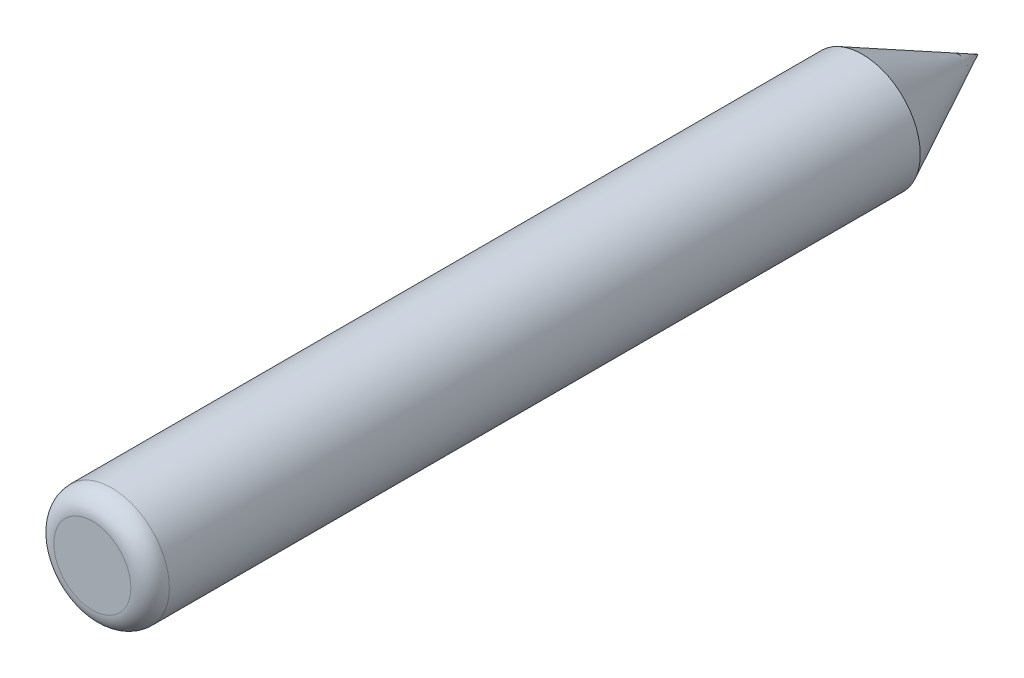
ISO-10303-21;
HEADER;
FILE_DESCRIPTION(('STEP AP214'),'2;1');
FILE_NAME('part.step','',(''),(''),'','','');
FILE_SCHEMA(('AUTOMOTIVE_DESIGN { 1 0 10303 214 1 1 1 1 }'));
ENDSEC;
DATA;
#1=APPLICATION_CONTEXT('core data for automotive mechanical design processes');
#2=APPLICATION_PROTOCOL_DEFINITION('international standard','automotive_design',2000,#1);
#3=PRODUCT_CONTEXT('',#1,'mechanical');
#4=PRODUCT('Part','Part','',(#3));
#5=PRODUCT_RELATED_PRODUCT_CATEGORY('part','',(#4));
#6=PRODUCT_DEFINITION_FORMATION('','',#4);
#7=PRODUCT_DEFINITION_CONTEXT('part definition',#1,'design');
#8=PRODUCT_DEFINITION('design','',#6,#7);
#9=PRODUCT_DEFINITION_SHAPE('','',#8);
#10=(LENGTH_UNIT() NAMED_UNIT(*) SI_UNIT(.MILLI.,.METRE.));
#11=(NAMED_UNIT(*) PLANE_ANGLE_UNIT() SI_UNIT($,.RADIAN.));
#12=(NAMED_UNIT(*) SI_UNIT($,.STERADIAN.) SOLID_ANGLE_UNIT());
#13=UNCERTAINTY_MEASURE_WITH_UNIT(LENGTH_MEASURE(1.E-05),#10,'distance_accuracy_value','');
#14=(GEOMETRIC_REPRESENTATION_CONTEXT(3) GLOBAL_UNCERTAINTY_ASSIGNED_CONTEXT((#13)) GLOBAL_UNIT_ASSIGNED_CONTEXT((#10,
#11,#12)) REPRESENTATION_CONTEXT('',''));
#15=CARTESIAN_POINT('',(0.,0.,0.));
#16=DIRECTION('',(0.,0.,1.));
#17=DIRECTION('',(1.,0.,0.));
#18=AXIS2_PLACEMENT_3D('',#15,#16,#17);
#19=CARTESIAN_POINT('',(0.,0.,80.));
#20=DIRECTION('',(0.,0.,-1.));
#21=DIRECTION('',(-1.,0.,0.));
#22=AXIS2_PLACEMENT_3D('',#19,#20,#21);
#23=CYLINDRICAL_SURFACE('',#22,6.);
#24=CARTESIAN_POINT('',(0.,0.,78.));
#25=DIRECTION('',(0.,0.,1.));
#26=DIRECTION('',(1.,0.,0.));
#27=AXIS2_PLACEMENT_3D('',#24,#25,#26);
#28=CIRCLE('',#27,6.);
#29=CARTESIAN_POINT('',(6.,0.,78.));
#30=VERTEX_POINT('',#29);
#31=EDGE_CURVE('E11',#30,#30,#28,.F.);
#32=ORIENTED_EDGE('',*,*,#31,.T.);
#33=EDGE_LOOP('',(#32));
#34=FACE_BOUND('',#33,.T.);
#35=CARTESIAN_POINT('',(0.,0.,0.));
#36=DIRECTION('',(0.,0.,1.));
#37=DIRECTION('',(1.,0.,0.));
#38=AXIS2_PLACEMENT_3D('',#35,#36,#37);
#39=CIRCLE('',#38,6.);
#40=CARTESIAN_POINT('',(6.,0.,0.));
#41=VERTEX_POINT('',#40);
#42=EDGE_CURVE('E62',#41,#41,#39,.T.);
#43=ORIENTED_EDGE('',*,*,#42,.T.);
#44=EDGE_LOOP('',(#43));
#45=FACE_BOUND('',#44,.T.);
#46=ADVANCED_FACE('F32',(#34,#45),#23,.T.);
#47=CARTESIAN_POINT('',(0.,0.,80.));
#48=DIRECTION('',(0.,0.,1.));
#49=DIRECTION('',(1.,0.,0.));
#50=AXIS2_PLACEMENT_3D('',#47,#48,#49);
#51=PLANE('',#50);
#52=CARTESIAN_POINT('',(0.,0.,80.));
#53=DIRECTION('',(0.,0.,1.));
#54=DIRECTION('',(1.,0.,0.));
#55=AXIS2_PLACEMENT_3D('',#52,#53,#54);
#56=CIRCLE('',#55,4.);
#57=CARTESIAN_POINT('',(4.,0.,80.));
#58=VERTEX_POINT('',#57);
#59=EDGE_CURVE('E39',#58,#58,#56,.T.);
#60=ORIENTED_EDGE('',*,*,#59,.T.);
#61=EDGE_LOOP('',(#60));
#62=FACE_BOUND('',#61,.T.);
#63=ADVANCED_FACE('F44',(#62),#51,.T.);
#64=CARTESIAN_POINT('',(0.,0.,-12.));
#65=DIRECTION('',(0.,0.,1.));
#66=DIRECTION('',(1.,0.,0.));
#67=AXIS2_PLACEMENT_3D('',#64,#65,#66);
#68=CONICAL_SURFACE('',#67,0.,0.463647609000806);
#69=ORIENTED_EDGE('',*,*,#42,.F.);
#70=EDGE_LOOP('',(#69));
#71=FACE_BOUND('',#70,.T.);
#72=CARTESIAN_POINT('',(0.,0.,-12.));
#73=VERTEX_POINT('',#72);
#74=VERTEX_LOOP('',#73);
#75=FACE_BOUND('',#74,.T.);
#76=ADVANCED_FACE('F42',(#71,#75),#68,.T.);
#77=CARTESIAN_POINT('',(0.,0.,78.));
#78=DIRECTION('',(0.,0.,1.));
#79=DIRECTION('',(1.,0.,0.));
#80=AXIS2_PLACEMENT_3D('',#77,#78,#79);
#81=TOROIDAL_SURFACE('',#80,4.,2.);
#82=ORIENTED_EDGE('',*,*,#31,.F.);
#83=EDGE_LOOP('',(#82));
#84=FACE_BOUND('',#83,.T.);
#85=ORIENTED_EDGE('',*,*,#59,.F.);
#86=EDGE_LOOP('',(#85));
#87=FACE_BOUND('',#86,.T.);
#88=ADVANCED_FACE('F34',(#84,#87),#81,.T.);
#89=CLOSED_SHELL('',(#46,#63,#76,#88));
#90=MANIFOLD_SOLID_BREP('B2',#89);
#91=ADVANCED_BREP_SHAPE_REPRESENTATION('',(#18,#90),#14);
#92=SHAPE_DEFINITION_REPRESENTATION(#9,#91);
ENDSEC;
END-ISO-10303-21;
